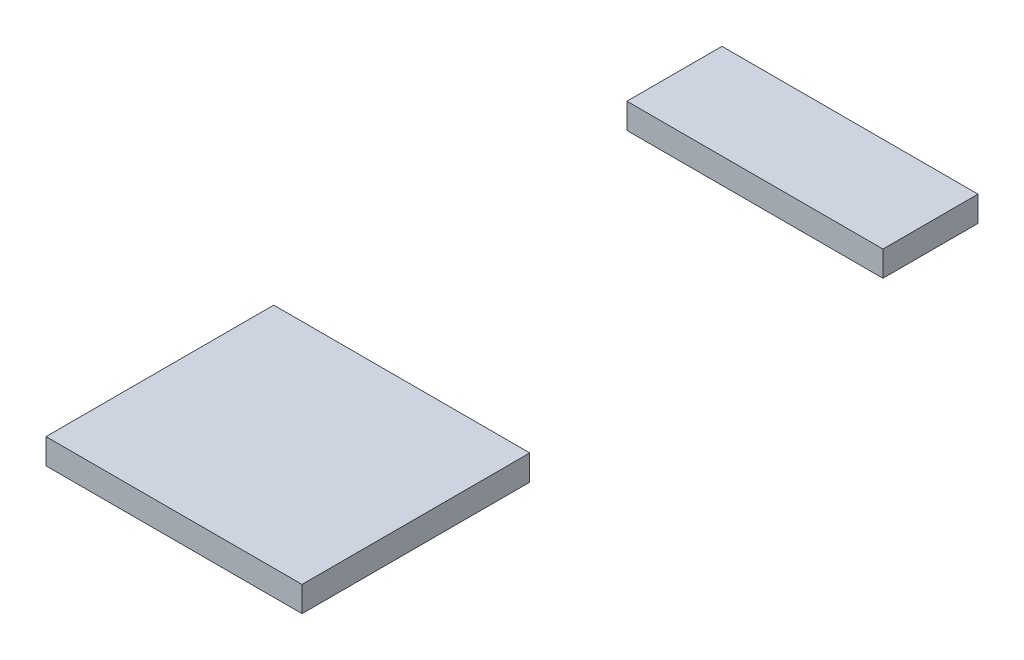
ISO-10303-21;
HEADER;
FILE_DESCRIPTION(('STEP AP214'),'2;1');
FILE_NAME('part.step','',(''),(''),'','','');
FILE_SCHEMA(('AUTOMOTIVE_DESIGN { 1 0 10303 214 1 1 1 1 }'));
ENDSEC;
DATA;
#1=APPLICATION_CONTEXT('core data for automotive mechanical design processes');
#2=APPLICATION_PROTOCOL_DEFINITION('international standard','automotive_design',2000,#1);
#3=PRODUCT_CONTEXT('',#1,'mechanical');
#4=PRODUCT('Part','Part','',(#3));
#5=PRODUCT_RELATED_PRODUCT_CATEGORY('part','',(#4));
#6=PRODUCT_DEFINITION_FORMATION('','',#4);
#7=PRODUCT_DEFINITION_CONTEXT('part definition',#1,'design');
#8=PRODUCT_DEFINITION('design','',#6,#7);
#9=PRODUCT_DEFINITION_SHAPE('','',#8);
#10=(LENGTH_UNIT() NAMED_UNIT(*) SI_UNIT(.MILLI.,.METRE.));
#11=(NAMED_UNIT(*) PLANE_ANGLE_UNIT() SI_UNIT($,.RADIAN.));
#12=(NAMED_UNIT(*) SI_UNIT($,.STERADIAN.) SOLID_ANGLE_UNIT());
#13=UNCERTAINTY_MEASURE_WITH_UNIT(LENGTH_MEASURE(1.E-05),#10,'distance_accuracy_value','');
#14=(GEOMETRIC_REPRESENTATION_CONTEXT(3) GLOBAL_UNCERTAINTY_ASSIGNED_CONTEXT((#13)) GLOBAL_UNIT_ASSIGNED_CONTEXT((#10,
#11,#12)) REPRESENTATION_CONTEXT('',''));
#15=CARTESIAN_POINT('',(0.,0.,0.));
#16=DIRECTION('',(0.,0.,1.));
#17=DIRECTION('',(1.,0.,0.));
#18=AXIS2_PLACEMENT_3D('',#15,#16,#17);
#19=CARTESIAN_POINT('',(30.3,-3.00000000000001,-80.));
#20=DIRECTION('',(1.,0.,0.));
#21=DIRECTION('',(0.,0.,-1.));
#22=AXIS2_PLACEMENT_3D('',#19,#20,#21);
#23=PLANE('',#22);
#24=DIRECTION('',(0.,0.,-1.));
#25=VECTOR('',#24,1.);
#26=CARTESIAN_POINT('',(30.3,0.,-80.));
#27=LINE('',#26,#25);
#28=CARTESIAN_POINT('',(30.3,0.,-68.75));
#29=VERTEX_POINT('',#28);
#30=CARTESIAN_POINT('',(30.3,0.,-80.));
#31=VERTEX_POINT('',#30);
#32=EDGE_CURVE('E107',#29,#31,#27,.T.);
#33=ORIENTED_EDGE('',*,*,#32,.F.);
#34=DIRECTION('',(0.,1.,0.));
#35=VECTOR('',#34,1.);
#36=CARTESIAN_POINT('',(30.3,-3.00000000000001,-68.75));
#37=LINE('',#36,#35);
#38=CARTESIAN_POINT('',(30.3,-3.00000000000001,-68.75));
#39=VERTEX_POINT('',#38);
#40=EDGE_CURVE('E12',#39,#29,#37,.T.);
#41=ORIENTED_EDGE('',*,*,#40,.F.);
#42=DIRECTION('',(0.,0.,-1.));
#43=VECTOR('',#42,1.);
#44=CARTESIAN_POINT('',(30.3,-3.00000000000001,-80.));
#45=LINE('',#44,#43);
#46=CARTESIAN_POINT('',(30.3,-3.00000000000001,-80.));
#47=VERTEX_POINT('',#46);
#48=EDGE_CURVE('E101',#39,#47,#45,.T.);
#49=ORIENTED_EDGE('',*,*,#48,.T.);
#50=DIRECTION('',(0.,1.,0.));
#51=VECTOR('',#50,1.);
#52=CARTESIAN_POINT('',(30.3,-3.00000000000001,-80.));
#53=LINE('',#52,#51);
#54=EDGE_CURVE('E46',#47,#31,#53,.T.);
#55=ORIENTED_EDGE('',*,*,#54,.T.);
#56=EDGE_LOOP('',(#33,#41,#49,#55));
#57=FACE_BOUND('',#56,.T.);
#58=ADVANCED_FACE('F43',(#57),#23,.T.);
#59=CARTESIAN_POINT('',(30.3,-3.00000000000001,-68.75));
#60=DIRECTION('',(0.,0.,1.));
#61=DIRECTION('',(1.,0.,0.));
#62=AXIS2_PLACEMENT_3D('',#59,#60,#61);
#63=PLANE('',#62);
#64=DIRECTION('',(1.,0.,0.));
#65=VECTOR('',#64,1.);
#66=CARTESIAN_POINT('',(30.3,0.,-68.75));
#67=LINE('',#66,#65);
#68=CARTESIAN_POINT('',(0.,0.,-68.75));
#69=VERTEX_POINT('',#68);
#70=EDGE_CURVE('E103',#69,#29,#67,.T.);
#71=ORIENTED_EDGE('',*,*,#70,.F.);
#72=DIRECTION('',(0.,1.,0.));
#73=VECTOR('',#72,1.);
#74=CARTESIAN_POINT('',(0.,-3.00000000000001,-68.75));
#75=LINE('',#74,#73);
#76=CARTESIAN_POINT('',(0.,-3.00000000000001,-68.75));
#77=VERTEX_POINT('',#76);
#78=EDGE_CURVE('E52',#77,#69,#75,.T.);
#79=ORIENTED_EDGE('',*,*,#78,.F.);
#80=DIRECTION('',(1.,0.,0.));
#81=VECTOR('',#80,1.);
#82=CARTESIAN_POINT('',(30.3,-3.00000000000001,-68.75));
#83=LINE('',#82,#81);
#84=EDGE_CURVE('E98',#77,#39,#83,.T.);
#85=ORIENTED_EDGE('',*,*,#84,.T.);
#86=ORIENTED_EDGE('',*,*,#40,.T.);
#87=EDGE_LOOP('',(#71,#79,#85,#86));
#88=FACE_BOUND('',#87,.T.);
#89=ADVANCED_FACE('F117',(#88),#63,.T.);
#90=CARTESIAN_POINT('',(0.,-3.00000000000001,-80.));
#91=DIRECTION('',(-1.,0.,0.));
#92=DIRECTION('',(0.,0.,1.));
#93=AXIS2_PLACEMENT_3D('',#90,#91,#92);
#94=PLANE('',#93);
#95=DIRECTION('',(0.,0.,1.));
#96=VECTOR('',#95,1.);
#97=CARTESIAN_POINT('',(0.,0.,-80.));
#98=LINE('',#97,#96);
#99=CARTESIAN_POINT('',(0.,0.,-80.));
#100=VERTEX_POINT('',#99);
#101=EDGE_CURVE('E93',#100,#69,#98,.T.);
#102=ORIENTED_EDGE('',*,*,#101,.F.);
#103=DIRECTION('',(0.,1.,0.));
#104=VECTOR('',#103,1.);
#105=CARTESIAN_POINT('',(0.,-3.00000000000001,-80.));
#106=LINE('',#105,#104);
#107=CARTESIAN_POINT('',(0.,-3.00000000000001,-80.));
#108=VERTEX_POINT('',#107);
#109=EDGE_CURVE('E88',#108,#100,#106,.T.);
#110=ORIENTED_EDGE('',*,*,#109,.F.);
#111=DIRECTION('',(0.,0.,1.));
#112=VECTOR('',#111,1.);
#113=CARTESIAN_POINT('',(0.,-3.00000000000001,-80.));
#114=LINE('',#113,#112);
#115=EDGE_CURVE('E91',#108,#77,#114,.T.);
#116=ORIENTED_EDGE('',*,*,#115,.T.);
#117=ORIENTED_EDGE('',*,*,#78,.T.);
#118=EDGE_LOOP('',(#102,#110,#116,#117));
#119=FACE_BOUND('',#118,.T.);
#120=ADVANCED_FACE('F90',(#119),#94,.T.);
#121=CARTESIAN_POINT('',(0.,-3.00000000000001,-80.));
#122=DIRECTION('',(0.,0.,-1.));
#123=DIRECTION('',(-1.,0.,0.));
#124=AXIS2_PLACEMENT_3D('',#121,#122,#123);
#125=PLANE('',#124);
#126=DIRECTION('',(-1.,0.,0.));
#127=VECTOR('',#126,1.);
#128=CARTESIAN_POINT('',(0.,0.,-80.));
#129=LINE('',#128,#127);
#130=EDGE_CURVE('E110',#31,#100,#129,.T.);
#131=ORIENTED_EDGE('',*,*,#130,.F.);
#132=ORIENTED_EDGE('',*,*,#54,.F.);
#133=DIRECTION('',(-1.,0.,0.));
#134=VECTOR('',#133,1.);
#135=CARTESIAN_POINT('',(0.,-3.00000000000001,-80.));
#136=LINE('',#135,#134);
#137=EDGE_CURVE('E97',#47,#108,#136,.T.);
#138=ORIENTED_EDGE('',*,*,#137,.T.);
#139=ORIENTED_EDGE('',*,*,#109,.T.);
#140=EDGE_LOOP('',(#131,#132,#138,#139));
#141=FACE_BOUND('',#140,.T.);
#142=ADVANCED_FACE('F100',(#141),#125,.T.);
#143=CARTESIAN_POINT('',(0.,-3.00000000000001,0.));
#144=DIRECTION('',(0.,-1.,0.));
#145=DIRECTION('',(0.,0.,-1.));
#146=AXIS2_PLACEMENT_3D('',#143,#144,#145);
#147=PLANE('',#146);
#148=ORIENTED_EDGE('',*,*,#48,.F.);
#149=ORIENTED_EDGE('',*,*,#84,.F.);
#150=ORIENTED_EDGE('',*,*,#115,.F.);
#151=ORIENTED_EDGE('',*,*,#137,.F.);
#152=EDGE_LOOP('',(#148,#149,#150,#151));
#153=FACE_BOUND('',#152,.T.);
#154=ADVANCED_FACE('F96',(#153),#147,.T.);
#155=CARTESIAN_POINT('',(0.,0.,0.));
#156=DIRECTION('',(0.,-1.,0.));
#157=DIRECTION('',(0.,0.,-1.));
#158=AXIS2_PLACEMENT_3D('',#155,#156,#157);
#159=PLANE('',#158);
#160=ORIENTED_EDGE('',*,*,#32,.T.);
#161=ORIENTED_EDGE('',*,*,#130,.T.);
#162=ORIENTED_EDGE('',*,*,#101,.T.);
#163=ORIENTED_EDGE('',*,*,#70,.T.);
#164=EDGE_LOOP('',(#160,#161,#162,#163));
#165=FACE_BOUND('',#164,.T.);
#166=ADVANCED_FACE('F116',(#165),#159,.F.);
#167=CLOSED_SHELL('',(#58,#89,#120,#142,#154,#166));
#168=MANIFOLD_SOLID_BREP('B2',#167);
#169=CARTESIAN_POINT('',(0.,-3.00000000000001,-26.95));
#170=DIRECTION('',(-1.,0.,0.));
#171=DIRECTION('',(0.,0.,1.));
#172=AXIS2_PLACEMENT_3D('',#169,#170,#171);
#173=PLANE('',#172);
#174=DIRECTION('',(0.,0.,1.));
#175=VECTOR('',#174,1.);
#176=CARTESIAN_POINT('',(0.,0.,-26.95));
#177=LINE('',#176,#175);
#178=CARTESIAN_POINT('',(0.,0.,-26.95));
#179=VERTEX_POINT('',#178);
#180=CARTESIAN_POINT('',(0.,0.,0.));
#181=VERTEX_POINT('',#180);
#182=EDGE_CURVE('E231',#179,#181,#177,.T.);
#183=ORIENTED_EDGE('',*,*,#182,.F.);
#184=DIRECTION('',(0.,1.,0.));
#185=VECTOR('',#184,1.);
#186=CARTESIAN_POINT('',(0.,-3.00000000000001,-26.95));
#187=LINE('',#186,#185);
#188=CARTESIAN_POINT('',(0.,-3.00000000000001,-26.95));
#189=VERTEX_POINT('',#188);
#190=EDGE_CURVE('E41',#189,#179,#187,.T.);
#191=ORIENTED_EDGE('',*,*,#190,.F.);
#192=DIRECTION('',(0.,0.,1.));
#193=VECTOR('',#192,1.);
#194=CARTESIAN_POINT('',(0.,-3.00000000000001,-26.95));
#195=LINE('',#194,#193);
#196=CARTESIAN_POINT('',(0.,-3.00000000000001,0.));
#197=VERTEX_POINT('',#196);
#198=EDGE_CURVE('E225',#189,#197,#195,.T.);
#199=ORIENTED_EDGE('',*,*,#198,.T.);
#200=DIRECTION('',(0.,1.,0.));
#201=VECTOR('',#200,1.);
#202=CARTESIAN_POINT('',(0.,-3.00000000000001,0.));
#203=LINE('',#202,#201);
#204=EDGE_CURVE('E170',#197,#181,#203,.T.);
#205=ORIENTED_EDGE('',*,*,#204,.T.);
#206=EDGE_LOOP('',(#183,#191,#199,#205));
#207=FACE_BOUND('',#206,.T.);
#208=ADVANCED_FACE('F167',(#207),#173,.T.);
#209=CARTESIAN_POINT('',(0.,-3.00000000000001,-26.95));
#210=DIRECTION('',(0.,0.,-1.));
#211=DIRECTION('',(-1.,0.,0.));
#212=AXIS2_PLACEMENT_3D('',#209,#210,#211);
#213=PLANE('',#212);
#214=DIRECTION('',(-1.,0.,0.));
#215=VECTOR('',#214,1.);
#216=CARTESIAN_POINT('',(0.,0.,-26.95));
#217=LINE('',#216,#215);
#218=CARTESIAN_POINT('',(30.3,0.,-26.95));
#219=VERTEX_POINT('',#218);
#220=EDGE_CURVE('E227',#219,#179,#217,.T.);
#221=ORIENTED_EDGE('',*,*,#220,.F.);
#222=DIRECTION('',(0.,1.,0.));
#223=VECTOR('',#222,1.);
#224=CARTESIAN_POINT('',(30.3,-3.00000000000001,-26.95));
#225=LINE('',#224,#223);
#226=CARTESIAN_POINT('',(30.3,-3.00000000000001,-26.95));
#227=VERTEX_POINT('',#226);
#228=EDGE_CURVE('E176',#227,#219,#225,.T.);
#229=ORIENTED_EDGE('',*,*,#228,.F.);
#230=DIRECTION('',(-1.,0.,0.));
#231=VECTOR('',#230,1.);
#232=CARTESIAN_POINT('',(0.,-3.00000000000001,-26.95));
#233=LINE('',#232,#231);
#234=EDGE_CURVE('E222',#227,#189,#233,.T.);
#235=ORIENTED_EDGE('',*,*,#234,.T.);
#236=ORIENTED_EDGE('',*,*,#190,.T.);
#237=EDGE_LOOP('',(#221,#229,#235,#236));
#238=FACE_BOUND('',#237,.T.);
#239=ADVANCED_FACE('F241',(#238),#213,.T.);
#240=CARTESIAN_POINT('',(30.3,-3.00000000000001,-26.95));
#241=DIRECTION('',(1.,0.,0.));
#242=DIRECTION('',(0.,0.,-1.));
#243=AXIS2_PLACEMENT_3D('',#240,#241,#242);
#244=PLANE('',#243);
#245=DIRECTION('',(0.,0.,-1.));
#246=VECTOR('',#245,1.);
#247=CARTESIAN_POINT('',(30.3,0.,-26.95));
#248=LINE('',#247,#246);
#249=CARTESIAN_POINT('',(30.3,0.,0.));
#250=VERTEX_POINT('',#249);
#251=EDGE_CURVE('E217',#250,#219,#248,.T.);
#252=ORIENTED_EDGE('',*,*,#251,.F.);
#253=DIRECTION('',(0.,1.,0.));
#254=VECTOR('',#253,1.);
#255=CARTESIAN_POINT('',(30.3,-3.00000000000001,0.));
#256=LINE('',#255,#254);
#257=CARTESIAN_POINT('',(30.3,-3.00000000000001,0.));
#258=VERTEX_POINT('',#257);
#259=EDGE_CURVE('E212',#258,#250,#256,.T.);
#260=ORIENTED_EDGE('',*,*,#259,.F.);
#261=DIRECTION('',(0.,0.,-1.));
#262=VECTOR('',#261,1.);
#263=CARTESIAN_POINT('',(30.3,-3.00000000000001,-26.95));
#264=LINE('',#263,#262);
#265=EDGE_CURVE('E215',#258,#227,#264,.T.);
#266=ORIENTED_EDGE('',*,*,#265,.T.);
#267=ORIENTED_EDGE('',*,*,#228,.T.);
#268=EDGE_LOOP('',(#252,#260,#266,#267));
#269=FACE_BOUND('',#268,.T.);
#270=ADVANCED_FACE('F214',(#269),#244,.T.);
#271=CARTESIAN_POINT('',(0.,-3.00000000000001,0.));
#272=DIRECTION('',(0.,0.,1.));
#273=DIRECTION('',(1.,0.,0.));
#274=AXIS2_PLACEMENT_3D('',#271,#272,#273);
#275=PLANE('',#274);
#276=DIRECTION('',(1.,0.,0.));
#277=VECTOR('',#276,1.);
#278=CARTESIAN_POINT('',(0.,0.,0.));
#279=LINE('',#278,#277);
#280=EDGE_CURVE('E234',#181,#250,#279,.T.);
#281=ORIENTED_EDGE('',*,*,#280,.F.);
#282=ORIENTED_EDGE('',*,*,#204,.F.);
#283=DIRECTION('',(1.,0.,0.));
#284=VECTOR('',#283,1.);
#285=CARTESIAN_POINT('',(0.,-3.00000000000001,0.));
#286=LINE('',#285,#284);
#287=EDGE_CURVE('E221',#197,#258,#286,.T.);
#288=ORIENTED_EDGE('',*,*,#287,.T.);
#289=ORIENTED_EDGE('',*,*,#259,.T.);
#290=EDGE_LOOP('',(#281,#282,#288,#289));
#291=FACE_BOUND('',#290,.T.);
#292=ADVANCED_FACE('F224',(#291),#275,.T.);
#293=CARTESIAN_POINT('',(0.,-3.00000000000001,0.));
#294=DIRECTION('',(0.,1.,0.));
#295=DIRECTION('',(0.,0.,1.));
#296=AXIS2_PLACEMENT_3D('',#293,#294,#295);
#297=PLANE('',#296);
#298=ORIENTED_EDGE('',*,*,#198,.F.);
#299=ORIENTED_EDGE('',*,*,#234,.F.);
#300=ORIENTED_EDGE('',*,*,#265,.F.);
#301=ORIENTED_EDGE('',*,*,#287,.F.);
#302=EDGE_LOOP('',(#298,#299,#300,#301));
#303=FACE_BOUND('',#302,.T.);
#304=ADVANCED_FACE('F220',(#303),#297,.F.);
#305=CARTESIAN_POINT('',(0.,0.,0.));
#306=DIRECTION('',(0.,1.,0.));
#307=DIRECTION('',(0.,0.,1.));
#308=AXIS2_PLACEMENT_3D('',#305,#306,#307);
#309=PLANE('',#308);
#310=ORIENTED_EDGE('',*,*,#182,.T.);
#311=ORIENTED_EDGE('',*,*,#280,.T.);
#312=ORIENTED_EDGE('',*,*,#251,.T.);
#313=ORIENTED_EDGE('',*,*,#220,.T.);
#314=EDGE_LOOP('',(#310,#311,#312,#313));
#315=FACE_BOUND('',#314,.T.);
#316=ADVANCED_FACE('F240',(#315),#309,.T.);
#317=CLOSED_SHELL('',(#208,#239,#270,#292,#304,#316));
#318=MANIFOLD_SOLID_BREP('B6',#317);
#319=ADVANCED_BREP_SHAPE_REPRESENTATION('',(#18,#168,#318),#14);
#320=SHAPE_DEFINITION_REPRESENTATION(#9,#319);
ENDSEC;
END-ISO-10303-21;
